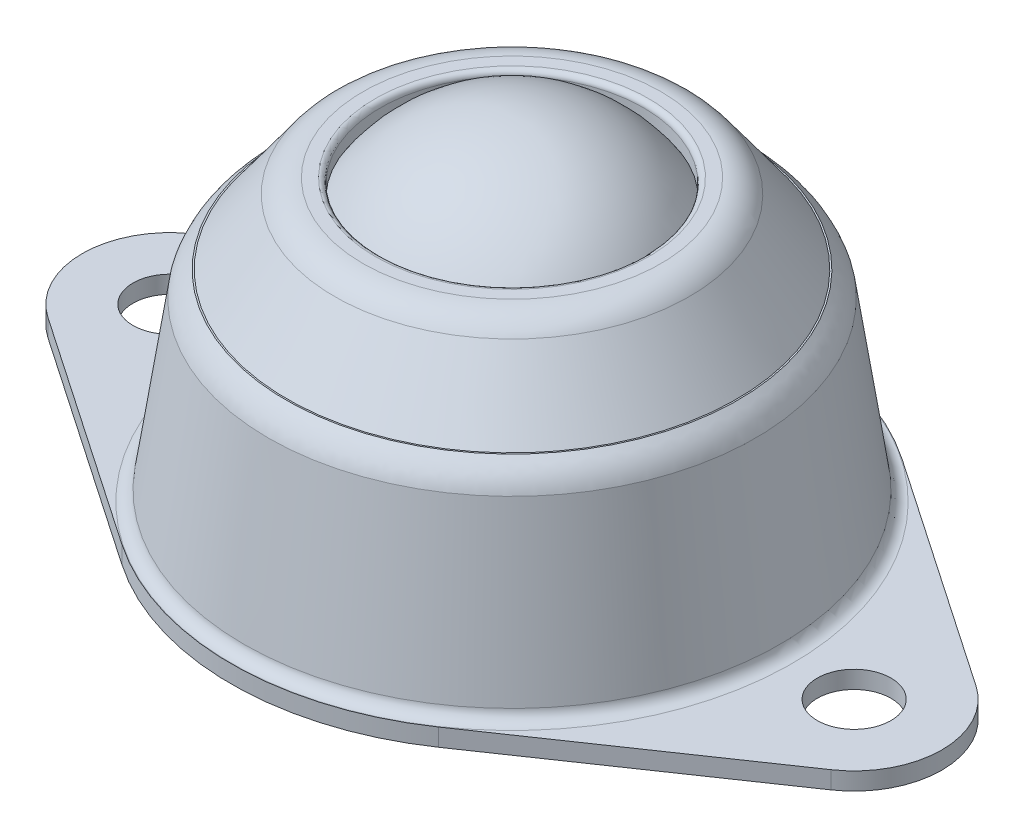
ISO-10303-21;
HEADER;
FILE_DESCRIPTION(('STEP AP214'),'2;1');
FILE_NAME('part.step','',(''),(''),'','','');
FILE_SCHEMA(('AUTOMOTIVE_DESIGN { 1 0 10303 214 1 1 1 1 }'));
ENDSEC;
DATA;
#1=APPLICATION_CONTEXT('core data for automotive mechanical design processes');
#2=APPLICATION_PROTOCOL_DEFINITION('international standard','automotive_design',2000,#1);
#3=PRODUCT_CONTEXT('',#1,'mechanical');
#4=PRODUCT('Part','Part','',(#3));
#5=PRODUCT_RELATED_PRODUCT_CATEGORY('part','',(#4));
#6=PRODUCT_DEFINITION_FORMATION('','',#4);
#7=PRODUCT_DEFINITION_CONTEXT('part definition',#1,'design');
#8=PRODUCT_DEFINITION('design','',#6,#7);
#9=PRODUCT_DEFINITION_SHAPE('','',#8);
#10=(LENGTH_UNIT() NAMED_UNIT(*) SI_UNIT(.MILLI.,.METRE.));
#11=(NAMED_UNIT(*) PLANE_ANGLE_UNIT() SI_UNIT($,.RADIAN.));
#12=(NAMED_UNIT(*) SI_UNIT($,.STERADIAN.) SOLID_ANGLE_UNIT());
#13=UNCERTAINTY_MEASURE_WITH_UNIT(LENGTH_MEASURE(1.E-05),#10,'distance_accuracy_value','');
#14=(GEOMETRIC_REPRESENTATION_CONTEXT(3) GLOBAL_UNCERTAINTY_ASSIGNED_CONTEXT((#13)) GLOBAL_UNIT_ASSIGNED_CONTEXT((#10,
#11,#12)) REPRESENTATION_CONTEXT('',''));
#15=CARTESIAN_POINT('',(0.,0.,0.));
#16=DIRECTION('',(0.,0.,1.));
#17=DIRECTION('',(1.,0.,0.));
#18=AXIS2_PLACEMENT_3D('',#15,#16,#17);
#19=CARTESIAN_POINT('',(-1.95060973816518,4.60747050791385,49.));
#20=DIRECTION('',(0.,1.,0.));
#21=DIRECTION('',(1.,0.,0.));
#22=AXIS2_PLACEMENT_3D('',#19,#20,#21);
#23=SPHERICAL_SURFACE('',#22,9.);
#24=CARTESIAN_POINT('',(-1.95060973816518,13.6074705079139,49.));
#25=VERTEX_POINT('',#24);
#26=VERTEX_LOOP('',#25);
#27=FACE_BOUND('',#26,.T.);
#28=ADVANCED_FACE('P0_F12',(#27),#23,.T.);
#29=CLOSED_SHELL('',(#28));
#30=MANIFOLD_SOLID_BREP('P0_B1',#29);
#31=CARTESIAN_POINT('',(-1.95060973816518,-6.2716566454268,49.));
#32=DIRECTION('',(0.,-1.,0.));
#33=DIRECTION('',(0.,0.,-1.));
#34=AXIS2_PLACEMENT_3D('',#31,#32,#33);
#35=CONICAL_SURFACE('',#34,15.4892940830772,0.146458693317037);
#36=CARTESIAN_POINT('',(-1.95060973816518,-4.81974726934143,49.));
#37=DIRECTION('',(0.,1.,0.));
#38=DIRECTION('',(0.,0.,1.));
#39=AXIS2_PLACEMENT_3D('',#36,#37,#38);
#40=CIRCLE('',#39,15.2751157529741);
#41=CARTESIAN_POINT('',(-1.95060973816518,-4.81974726934143,64.2751157529741));
#42=VERTEX_POINT('',#41);
#43=EDGE_CURVE('P1_E210',#42,#42,#40,.T.);
#44=ORIENTED_EDGE('',*,*,#43,.T.);
#45=EDGE_LOOP('',(#44));
#46=FACE_BOUND('',#45,.T.);
#47=CARTESIAN_POINT('',(-1.95060973816518,4.66035819329168,49.));
#48=DIRECTION('',(0.,-1.,0.));
#49=DIRECTION('',(0.,0.,-1.));
#50=AXIS2_PLACEMENT_3D('',#47,#48,#49);
#51=CIRCLE('',#50,13.8766585278661);
#52=CARTESIAN_POINT('',(-1.95060973816518,4.66035819329168,35.1233414721339));
#53=VERTEX_POINT('',#52);
#54=EDGE_CURVE('P1_E213',#53,#53,#51,.T.);
#55=ORIENTED_EDGE('',*,*,#54,.T.);
#56=EDGE_LOOP('',(#55));
#57=FACE_BOUND('',#56,.T.);
#58=ADVANCED_FACE('P1_F16',(#46,#57),#35,.T.);
#59=CARTESIAN_POINT('',(-10.441880643184,9.58240769344695,49.));
#60=DIRECTION('',(0.,1.,0.));
#61=DIRECTION('',(0.,0.,1.));
#62=AXIS2_PLACEMENT_3D('',#59,#60,#61);
#63=PLANE('',#62);
#64=CARTESIAN_POINT('',(-1.95060973816518,9.58240769344695,49.));
#65=DIRECTION('',(0.,-1.,0.));
#66=DIRECTION('',(0.,0.,-1.));
#67=AXIS2_PLACEMENT_3D('',#64,#65,#66);
#68=CIRCLE('',#67,7.5);
#69=CARTESIAN_POINT('',(-1.95060973816518,9.58240769344695,41.5));
#70=VERTEX_POINT('',#69);
#71=EDGE_CURVE('P1_E234',#70,#70,#68,.T.);
#72=ORIENTED_EDGE('',*,*,#71,.F.);
#73=EDGE_LOOP('',(#72));
#74=FACE_BOUND('',#73,.T.);
#75=CARTESIAN_POINT('',(-1.95060973816518,9.58240769344695,49.));
#76=DIRECTION('',(0.,-1.,0.));
#77=DIRECTION('',(0.,0.,-1.));
#78=AXIS2_PLACEMENT_3D('',#75,#76,#77);
#79=CIRCLE('',#78,8.49127090501881);
#80=CARTESIAN_POINT('',(-1.95060973816518,9.58240769344695,40.5087290949812));
#81=VERTEX_POINT('',#80);
#82=EDGE_CURVE('P1_E145',#81,#81,#79,.T.);
#83=ORIENTED_EDGE('',*,*,#82,.T.);
#84=EDGE_LOOP('',(#83));
#85=FACE_BOUND('',#84,.T.);
#86=ADVANCED_FACE('P1_F184',(#74,#85),#63,.F.);
#87=CARTESIAN_POINT('',(-1.95060973816518,-11.8288477178085,49.));
#88=DIRECTION('',(0.,-1.,0.));
#89=DIRECTION('',(0.,0.,-1.));
#90=AXIS2_PLACEMENT_3D('',#87,#88,#89);
#91=CYLINDRICAL_SURFACE('',#90,7.5);
#92=CARTESIAN_POINT('',(-1.95060973816518,10.282407693447,49.));
#93=DIRECTION('',(0.,1.,0.));
#94=DIRECTION('',(0.,0.,1.));
#95=AXIS2_PLACEMENT_3D('',#92,#93,#94);
#96=CIRCLE('',#95,7.5);
#97=CARTESIAN_POINT('',(-1.95060973816518,10.282407693447,56.5));
#98=VERTEX_POINT('',#97);
#99=EDGE_CURVE('P1_E11',#98,#98,#96,.T.);
#100=ORIENTED_EDGE('',*,*,#99,.T.);
#101=EDGE_LOOP('',(#100));
#102=FACE_BOUND('',#101,.T.);
#103=ORIENTED_EDGE('',*,*,#71,.T.);
#104=EDGE_LOOP('',(#103));
#105=FACE_BOUND('',#104,.T.);
#106=ADVANCED_FACE('P1_F180',(#102,#105),#91,.F.);
#107=CARTESIAN_POINT('',(-10.441880643184,10.582407693447,49.));
#108=DIRECTION('',(0.,1.,0.));
#109=DIRECTION('',(0.,0.,1.));
#110=AXIS2_PLACEMENT_3D('',#107,#108,#109);
#111=PLANE('',#110);
#112=CARTESIAN_POINT('',(-1.95060973816518,10.582407693447,49.));
#113=DIRECTION('',(0.,1.,0.));
#114=DIRECTION('',(0.,0.,1.));
#115=AXIS2_PLACEMENT_3D('',#112,#113,#114);
#116=CIRCLE('',#115,7.8);
#117=CARTESIAN_POINT('',(-1.95060973816518,10.582407693447,56.8));
#118=VERTEX_POINT('',#117);
#119=EDGE_CURVE('P1_E25',#118,#118,#116,.F.);
#120=ORIENTED_EDGE('',*,*,#119,.T.);
#121=EDGE_LOOP('',(#120));
#122=FACE_BOUND('',#121,.T.);
#123=CARTESIAN_POINT('',(-1.95060973816518,10.582407693447,49.));
#124=DIRECTION('',(0.,-1.,0.));
#125=DIRECTION('',(0.,0.,-1.));
#126=AXIS2_PLACEMENT_3D('',#123,#124,#125);
#127=CIRCLE('',#126,8.4912709050188);
#128=CARTESIAN_POINT('',(-1.95060973816518,10.582407693447,40.5087290949812));
#129=VERTEX_POINT('',#128);
#130=EDGE_CURVE('P1_E231',#129,#129,#127,.T.);
#131=ORIENTED_EDGE('',*,*,#130,.F.);
#132=EDGE_LOOP('',(#131));
#133=FACE_BOUND('',#132,.T.);
#134=ADVANCED_FACE('P1_F176',(#122,#133),#111,.T.);
#135=CARTESIAN_POINT('',(-1.95060973816518,8.58240769344695,49.));
#136=DIRECTION('',(0.,-1.,0.));
#137=DIRECTION('',(0.,0.,-1.));
#138=AXIS2_PLACEMENT_3D('',#135,#136,#137);
#139=TOROIDAL_SURFACE('',#138,8.49127090501881,2.);
#140=ORIENTED_EDGE('',*,*,#130,.T.);
#141=EDGE_LOOP('',(#140));
#142=FACE_BOUND('',#141,.T.);
#143=CARTESIAN_POINT('',(-1.95060973816518,9.76002382293537,49.));
#144=DIRECTION('',(0.,-1.,0.));
#145=DIRECTION('',(0.,0.,-1.));
#146=AXIS2_PLACEMENT_3D('',#143,#144,#145);
#147=CIRCLE('',#146,10.1078166827711);
#148=CARTESIAN_POINT('',(-1.95060973816518,9.76002382293537,38.8921833172289));
#149=VERTEX_POINT('',#148);
#150=EDGE_CURVE('P1_E228',#149,#149,#147,.T.);
#151=ORIENTED_EDGE('',*,*,#150,.F.);
#152=EDGE_LOOP('',(#151));
#153=FACE_BOUND('',#152,.T.);
#154=ADVANCED_FACE('P1_F172',(#142,#153),#139,.T.);
#155=CARTESIAN_POINT('',(-1.95060973816518,6.05240769344696,49.));
#156=DIRECTION('',(0.,-1.,0.));
#157=DIRECTION('',(0.,0.,-1.));
#158=AXIS2_PLACEMENT_3D('',#155,#156,#157);
#159=CONICAL_SURFACE('',#158,12.8087290949812,0.629583377949077);
#160=ORIENTED_EDGE('',*,*,#150,.T.);
#161=EDGE_LOOP('',(#160));
#162=FACE_BOUND('',#161,.T.);
#163=CARTESIAN_POINT('',(-1.95060973816518,6.05240769344696,49.));
#164=DIRECTION('',(0.,-1.,0.));
#165=DIRECTION('',(0.,0.,-1.));
#166=AXIS2_PLACEMENT_3D('',#163,#164,#165);
#167=CIRCLE('',#166,12.8087290949812);
#168=CARTESIAN_POINT('',(-1.95060973816518,6.05240769344696,36.1912709050188));
#169=VERTEX_POINT('',#168);
#170=EDGE_CURVE('P1_E219',#169,#169,#167,.T.);
#171=ORIENTED_EDGE('',*,*,#170,.F.);
#172=EDGE_LOOP('',(#171));
#173=FACE_BOUND('',#172,.T.);
#174=ADVANCED_FACE('P1_F168',(#162,#173),#159,.T.);
#175=CARTESIAN_POINT('',(-14.4506097381652,6.05240769344696,49.));
#176=DIRECTION('',(0.,1.,0.));
#177=DIRECTION('',(0.,0.,1.));
#178=AXIS2_PLACEMENT_3D('',#175,#176,#177);
#179=PLANE('',#178);
#180=ORIENTED_EDGE('',*,*,#170,.T.);
#181=EDGE_LOOP('',(#180));
#182=FACE_BOUND('',#181,.T.);
#183=CARTESIAN_POINT('',(-1.95060973816518,6.05240769344696,49.));
#184=DIRECTION('',(0.,-1.,0.));
#185=DIRECTION('',(0.,0.,-1.));
#186=AXIS2_PLACEMENT_3D('',#183,#184,#185);
#187=CIRCLE('',#186,12.8924283725623);
#188=CARTESIAN_POINT('',(-1.95060973816518,6.05240769344696,36.1075716274377));
#189=VERTEX_POINT('',#188);
#190=EDGE_CURVE('P1_E215',#189,#189,#187,.T.);
#191=ORIENTED_EDGE('',*,*,#190,.F.);
#192=EDGE_LOOP('',(#191));
#193=FACE_BOUND('',#192,.T.);
#194=ADVANCED_FACE('P1_F163',(#182,#193),#179,.T.);
#195=CARTESIAN_POINT('',(-15.8272682660313,4.66035819329168,49.));
#196=CARTESIAN_POINT('',(-15.8191064758816,4.6850538361552,49.));
#197=CARTESIAN_POINT('',(-15.8109446857319,4.70974947901874,49.));
#198=CARTESIAN_POINT('',(-15.7987020005074,4.74679294331405,49.));
#199=CARTESIAN_POINT('',(-15.7911287345074,4.76948983380939,49.));
#200=CARTESIAN_POINT('',(-15.7770840785491,4.80940371465037,49.));
#201=CARTESIAN_POINT('',(-15.7698122009523,4.82928423418318,49.));
#202=CARTESIAN_POINT('',(-15.7321998455869,4.92826674440635,49.));
#203=CARTESIAN_POINT('',(-15.6980871010981,5.0061120716949,49.));
#204=CARTESIAN_POINT('',(-15.5837877947078,5.23405301989266,49.));
#205=CARTESIAN_POINT('',(-15.4914830555105,5.37844839844446,49.));
#206=CARTESIAN_POINT('',(-15.332366465786,5.57789851980176,49.));
#207=CARTESIAN_POINT('',(-15.275927162519,5.64154493597412,49.));
#208=CARTESIAN_POINT('',(-15.2016988288033,5.7172023017542,49.));
#209=CARTESIAN_POINT('',(-15.1791547246241,5.73960822377018,49.));
#210=CARTESIAN_POINT('',(-15.1562139194125,5.761571084609,49.));
#211=CARTESIAN_POINT('',(-15.1408337457316,5.77611401301725,49.));
#212=CARTESIAN_POINT('',(-15.1321701874857,5.78417215198515,49.));
#213=CARTESIAN_POINT('',(-15.1084708369317,5.8061586717771,49.));
#214=CARTESIAN_POINT('',(-15.0136734347159,5.89410475094492,49.));
#215=CARTESIAN_POINT('',(-14.9188760325001,5.98205083011271,49.));
#216=CARTESIAN_POINT('',(-14.8430381107275,6.05240769344696,49.));
#217=B_SPLINE_CURVE_WITH_KNOTS('',3,(#195,#196,#197,#198,#199,#200,#201,#202,#203,#204,#205,
#206,#207,#208,#209,#210,#211,#212,#213,#214,#215,#216),.UNSPECIFIED.,.F.,.F.,(4,2,2,2,2,2,2,1,
2,2,1,4),(0.,0.0624999999999958,0.0937499999999931,0.12499999999999,0.24999999999998,
0.49999999999996,0.624999999999951,0.656249999999949,0.671874999999948,0.687499999999948,
0.749999999999959,1.),.UNSPECIFIED.);
#218=CARTESIAN_POINT('',(-1.95060973816518,-11.8288477178085,49.));
#219=DIRECTION('',(0.,-1.,0.));
#220=AXIS1_PLACEMENT('',#218,#219);
#221=SURFACE_OF_REVOLUTION('',#217,#220);
#222=ORIENTED_EDGE('',*,*,#190,.T.);
#223=EDGE_LOOP('',(#222));
#224=FACE_BOUND('',#223,.T.);
#225=ORIENTED_EDGE('',*,*,#54,.F.);
#226=EDGE_LOOP('',(#225));
#227=FACE_BOUND('',#226,.T.);
#228=ADVANCED_FACE('P1_F158',(#224,#227),#221,.F.);
#229=CARTESIAN_POINT('',(-1.95060973816518,-6.41759230655305,49.));
#230=DIRECTION('',(0.,-1.,0.));
#231=DIRECTION('',(0.,0.,-1.));
#232=AXIS2_PLACEMENT_3D('',#229,#230,#231);
#233=CONICAL_SURFACE('',#232,14.5,0.146458693317037);
#234=CARTESIAN_POINT('',(-1.95060973816518,4.4287664292616,49.));
#235=DIRECTION('',(0.,-1.,0.));
#236=DIRECTION('',(0.,0.,-1.));
#237=AXIS2_PLACEMENT_3D('',#234,#235,#236);
#238=CIRCLE('',#237,12.9);
#239=CARTESIAN_POINT('',(-1.95060973816518,4.4287664292616,36.1));
#240=VERTEX_POINT('',#239);
#241=EDGE_CURVE('P1_E216',#240,#240,#238,.T.);
#242=ORIENTED_EDGE('',*,*,#241,.F.);
#243=EDGE_LOOP('',(#242));
#244=FACE_BOUND('',#243,.T.);
#245=CARTESIAN_POINT('',(-1.95060973816518,-6.41759230655305,49.));
#246=DIRECTION('',(0.,1.,0.));
#247=DIRECTION('',(0.,0.,1.));
#248=AXIS2_PLACEMENT_3D('',#245,#246,#247);
#249=CIRCLE('',#248,14.5);
#250=CARTESIAN_POINT('',(-1.95060973816518,-6.41759230655305,63.5));
#251=VERTEX_POINT('',#250);
#252=EDGE_CURVE('P1_E311',#251,#251,#249,.T.);
#253=ORIENTED_EDGE('',*,*,#252,.F.);
#254=EDGE_LOOP('',(#253));
#255=FACE_BOUND('',#254,.T.);
#256=ADVANCED_FACE('P1_F162',(#244,#255),#233,.F.);
#257=CARTESIAN_POINT('',(-14.8506097381652,4.4287664292616,49.));
#258=CARTESIAN_POINT('',(-14.730234992126,4.79299188513002,49.));
#259=CARTESIAN_POINT('',(-14.4506097381652,5.05240769344695,49.));
#260=B_SPLINE_CURVE_WITH_KNOTS('',2,(#257,#258,#259),.UNSPECIFIED.,.F.,.F.,(3,3),(0.,1.),.UNSPECIFIED.);
#261=CARTESIAN_POINT('',(-1.95060973816518,-11.8288477178085,49.));
#262=DIRECTION('',(0.,-1.,0.));
#263=AXIS1_PLACEMENT('',#261,#262);
#264=SURFACE_OF_REVOLUTION('',#260,#263);
#265=CARTESIAN_POINT('',(-1.95060973816518,5.05240769344695,49.));
#266=DIRECTION('',(0.,-1.,0.));
#267=DIRECTION('',(0.,0.,-1.));
#268=AXIS2_PLACEMENT_3D('',#265,#266,#267);
#269=CIRCLE('',#268,12.5);
#270=CARTESIAN_POINT('',(-1.95060973816518,5.05240769344695,36.5));
#271=VERTEX_POINT('',#270);
#272=EDGE_CURVE('P1_E222',#271,#271,#269,.T.);
#273=ORIENTED_EDGE('',*,*,#272,.F.);
#274=EDGE_LOOP('',(#273));
#275=FACE_BOUND('',#274,.T.);
#276=ORIENTED_EDGE('',*,*,#241,.T.);
#277=EDGE_LOOP('',(#276));
#278=FACE_BOUND('',#277,.T.);
#279=ADVANCED_FACE('P1_F299',(#275,#278),#264,.T.);
#280=CARTESIAN_POINT('',(-14.4506097381652,5.05240769344695,49.));
#281=DIRECTION('',(0.,1.,0.));
#282=DIRECTION('',(0.,0.,1.));
#283=AXIS2_PLACEMENT_3D('',#280,#281,#282);
#284=PLANE('',#283);
#285=CARTESIAN_POINT('',(-1.95060973816518,5.05240769344695,49.));
#286=DIRECTION('',(0.,-1.,0.));
#287=DIRECTION('',(0.,0.,-1.));
#288=AXIS2_PLACEMENT_3D('',#285,#286,#287);
#289=CIRCLE('',#288,12.3);
#290=CARTESIAN_POINT('',(-1.95060973816518,5.05240769344695,36.7));
#291=VERTEX_POINT('',#290);
#292=EDGE_CURVE('P1_E517',#291,#291,#289,.T.);
#293=ORIENTED_EDGE('',*,*,#292,.F.);
#294=EDGE_LOOP('',(#293));
#295=FACE_BOUND('',#294,.T.);
#296=ORIENTED_EDGE('',*,*,#272,.T.);
#297=EDGE_LOOP('',(#296));
#298=FACE_BOUND('',#297,.T.);
#299=ADVANCED_FACE('P1_F295',(#295,#298),#284,.F.);
#300=CARTESIAN_POINT('',(-1.95060973816518,5.05240769344695,49.));
#301=DIRECTION('',(0.,-1.,0.));
#302=DIRECTION('',(0.,0.,-1.));
#303=AXIS2_PLACEMENT_3D('',#300,#301,#302);
#304=CONICAL_SURFACE('',#303,12.3,0.629583377949078);
#305=CARTESIAN_POINT('',(-1.95060973816518,9.17121575819116,49.));
#306=DIRECTION('',(0.,-1.,0.));
#307=DIRECTION('',(0.,0.,-1.));
#308=AXIS2_PLACEMENT_3D('',#305,#306,#307);
#309=CIRCLE('',#308,9.29954379389495);
#310=CARTESIAN_POINT('',(-1.95060973816518,9.17121575819116,39.700456206105));
#311=VERTEX_POINT('',#310);
#312=EDGE_CURVE('P1_E519',#311,#311,#309,.T.);
#313=ORIENTED_EDGE('',*,*,#312,.F.);
#314=EDGE_LOOP('',(#313));
#315=FACE_BOUND('',#314,.T.);
#316=ORIENTED_EDGE('',*,*,#292,.T.);
#317=EDGE_LOOP('',(#316));
#318=FACE_BOUND('',#317,.T.);
#319=ADVANCED_FACE('P1_F263',(#315,#318),#304,.F.);
#320=CARTESIAN_POINT('',(-1.95060973816518,8.58240769344695,49.));
#321=DIRECTION('',(0.,-1.,0.));
#322=DIRECTION('',(0.,0.,-1.));
#323=AXIS2_PLACEMENT_3D('',#320,#321,#322);
#324=TOROIDAL_SURFACE('',#323,8.49127090501881,1.);
#325=ORIENTED_EDGE('',*,*,#82,.F.);
#326=EDGE_LOOP('',(#325));
#327=FACE_BOUND('',#326,.T.);
#328=ORIENTED_EDGE('',*,*,#312,.T.);
#329=EDGE_LOOP('',(#328));
#330=FACE_BOUND('',#329,.T.);
#331=ADVANCED_FACE('P1_F254',(#327,#330),#324,.F.);
#332=CARTESIAN_POINT('',(17.5493902618348,-5.41759230655305,49.));
#333=DIRECTION('',(0.,-1.,0.));
#334=DIRECTION('',(0.,0.,-1.));
#335=AXIS2_PLACEMENT_3D('',#332,#333,#334);
#336=PLANE('',#335);
#337=CARTESIAN_POINT('',(-1.95060973816518,-5.41759230655305,49.));
#338=DIRECTION('',(0.,-1.,0.));
#339=DIRECTION('',(0.,0.,-1.));
#340=AXIS2_PLACEMENT_3D('',#337,#338,#339);
#341=CIRCLE('',#340,15.9676216111282);
#342=CARTESIAN_POINT('',(-1.95060973816518,-5.41759230655305,33.0323783888718));
#343=VERTEX_POINT('',#342);
#344=EDGE_CURVE('P1_E238',#343,#343,#341,.T.);
#345=ORIENTED_EDGE('',*,*,#344,.T.);
#346=EDGE_LOOP('',(#345));
#347=FACE_BOUND('',#346,.T.);
#348=CARTESIAN_POINT('',(17.5493902618348,-5.41759230655305,49.));
#349=DIRECTION('',(0.,1.,0.));
#350=DIRECTION('',(0.,0.,-1.));
#351=AXIS2_PLACEMENT_3D('',#348,#349,#350);
#352=CIRCLE('',#351,5.);
#353=CARTESIAN_POINT('',(20.3699030823476,-5.41759230655305,53.1285236379755));
#354=VERTEX_POINT('',#353);
#355=CARTESIAN_POINT('',(20.3699030823476,-5.41759230655305,44.8714763620244));
#356=VERTEX_POINT('',#355);
#357=EDGE_CURVE('P1_E130',#354,#356,#352,.T.);
#358=ORIENTED_EDGE('',*,*,#357,.T.);
#359=DIRECTION('',(-0.825704727595109,0.,-0.564102564102564));
#360=VECTOR('',#359,1.);
#361=CARTESIAN_POINT('',(20.3699030823476,-5.41759230655305,44.8714763620244));
#362=LINE('',#361,#360);
#363=CARTESIAN_POINT('',(7.07503128747584,-5.41759230655305,35.7887243584783));
#364=VERTEX_POINT('',#363);
#365=EDGE_CURVE('P1_E77',#356,#364,#362,.T.);
#366=ORIENTED_EDGE('',*,*,#365,.T.);
#367=CARTESIAN_POINT('',(-1.95060973816518,-5.41759230655305,49.));
#368=DIRECTION('',(0.,1.,0.));
#369=DIRECTION('',(0.,0.,1.));
#370=AXIS2_PLACEMENT_3D('',#367,#368,#369);
#371=CIRCLE('',#370,16.);
#372=CARTESIAN_POINT('',(-10.9762507638062,-5.41759230655305,35.7887243584783));
#373=VERTEX_POINT('',#372);
#374=EDGE_CURVE('P1_E328',#364,#373,#371,.T.);
#375=ORIENTED_EDGE('',*,*,#374,.T.);
#376=DIRECTION('',(-0.825704727595109,0.,0.564102564102564));
#377=VECTOR('',#376,1.);
#378=CARTESIAN_POINT('',(-24.271122558678,-5.41759230655305,44.8714763620244));
#379=LINE('',#378,#377);
#380=CARTESIAN_POINT('',(-24.271122558678,-5.41759230655305,44.8714763620244));
#381=VERTEX_POINT('',#380);
#382=EDGE_CURVE('P1_E330',#373,#381,#379,.T.);
#383=ORIENTED_EDGE('',*,*,#382,.T.);
#384=CARTESIAN_POINT('',(-21.4506097381652,-5.41759230655305,49.));
#385=DIRECTION('',(0.,1.,0.));
#386=DIRECTION('',(0.,0.,1.));
#387=AXIS2_PLACEMENT_3D('',#384,#385,#386);
#388=CIRCLE('',#387,5.);
#389=CARTESIAN_POINT('',(-24.271122558678,-5.41759230655305,53.1285236379755));
#390=VERTEX_POINT('',#389);
#391=EDGE_CURVE('P1_E97',#381,#390,#388,.T.);
#392=ORIENTED_EDGE('',*,*,#391,.T.);
#393=DIRECTION('',(0.825704727595109,0.,0.564102564102564));
#394=VECTOR('',#393,1.);
#395=CARTESIAN_POINT('',(-24.271122558678,-5.41759230655305,53.1285236379755));
#396=LINE('',#395,#394);
#397=CARTESIAN_POINT('',(-10.9762507638062,-5.41759230655305,62.2112756415217));
#398=VERTEX_POINT('',#397);
#399=EDGE_CURVE('P1_E90',#390,#398,#396,.T.);
#400=ORIENTED_EDGE('',*,*,#399,.T.);
#401=CARTESIAN_POINT('',(-1.95060973816518,-5.41759230655305,49.));
#402=DIRECTION('',(0.,1.,0.));
#403=DIRECTION('',(0.,0.,-1.));
#404=AXIS2_PLACEMENT_3D('',#401,#402,#403);
#405=CIRCLE('',#404,16.);
#406=CARTESIAN_POINT('',(7.07503128747584,-5.41759230655305,62.2112756415217));
#407=VERTEX_POINT('',#406);
#408=EDGE_CURVE('P1_E95',#398,#407,#405,.T.);
#409=ORIENTED_EDGE('',*,*,#408,.T.);
#410=DIRECTION('',(0.825704727595109,0.,-0.564102564102564));
#411=VECTOR('',#410,1.);
#412=CARTESIAN_POINT('',(20.3699030823476,-5.41759230655305,53.1285236379755));
#413=LINE('',#412,#411);
#414=EDGE_CURVE('P1_E33',#407,#354,#413,.T.);
#415=ORIENTED_EDGE('',*,*,#414,.T.);
#416=EDGE_LOOP('',(#358,#366,#375,#383,#392,#400,#409,#415));
#417=FACE_BOUND('',#416,.T.);
#418=CARTESIAN_POINT('',(-21.4506097381652,-5.41759230655305,49.));
#419=DIRECTION('',(0.,1.,0.));
#420=DIRECTION('',(0.,0.,1.));
#421=AXIS2_PLACEMENT_3D('',#418,#419,#420);
#422=CIRCLE('',#421,2.1);
#423=CARTESIAN_POINT('',(-21.4506097381652,-5.41759230655305,51.1));
#424=VERTEX_POINT('',#423);
#425=EDGE_CURVE('P1_E119',#424,#424,#422,.T.);
#426=ORIENTED_EDGE('',*,*,#425,.F.);
#427=EDGE_LOOP('',(#426));
#428=FACE_BOUND('',#427,.T.);
#429=CARTESIAN_POINT('',(17.5493902618348,-5.41759230655305,49.));
#430=DIRECTION('',(0.,1.,0.));
#431=DIRECTION('',(0.,0.,-1.));
#432=AXIS2_PLACEMENT_3D('',#429,#430,#431);
#433=CIRCLE('',#432,2.1);
#434=CARTESIAN_POINT('',(17.5493902618348,-5.41759230655305,46.9));
#435=VERTEX_POINT('',#434);
#436=EDGE_CURVE('P1_E316',#435,#435,#433,.T.);
#437=ORIENTED_EDGE('',*,*,#436,.F.);
#438=EDGE_LOOP('',(#437));
#439=FACE_BOUND('',#438,.T.);
#440=ADVANCED_FACE('P1_F92',(#347,#417,#428,#439),#336,.F.);
#441=CARTESIAN_POINT('',(17.5493902618348,-6.41759230655305,49.));
#442=DIRECTION('',(0.,-1.,0.));
#443=DIRECTION('',(0.,0.,-1.));
#444=AXIS2_PLACEMENT_3D('',#441,#442,#443);
#445=PLANE('',#444);
#446=CARTESIAN_POINT('',(17.5493902618348,-6.41759230655305,49.));
#447=DIRECTION('',(0.,1.,0.));
#448=DIRECTION('',(0.,0.,-1.));
#449=AXIS2_PLACEMENT_3D('',#446,#447,#448);
#450=CIRCLE('',#449,2.1);
#451=CARTESIAN_POINT('',(17.5493902618348,-6.41759230655305,46.9));
#452=VERTEX_POINT('',#451);
#453=EDGE_CURVE('P1_E313',#452,#452,#450,.T.);
#454=ORIENTED_EDGE('',*,*,#453,.T.);
#455=EDGE_LOOP('',(#454));
#456=FACE_BOUND('',#455,.T.);
#457=CARTESIAN_POINT('',(17.5493902618348,-6.41759230655305,49.));
#458=DIRECTION('',(0.,1.,0.));
#459=DIRECTION('',(0.,0.,-1.));
#460=AXIS2_PLACEMENT_3D('',#457,#458,#459);
#461=CIRCLE('',#460,5.);
#462=CARTESIAN_POINT('',(20.3699030823476,-6.41759230655305,53.1285236379755));
#463=VERTEX_POINT('',#462);
#464=CARTESIAN_POINT('',(20.3699030823476,-6.41759230655305,44.8714763620244));
#465=VERTEX_POINT('',#464);
#466=EDGE_CURVE('P1_E115',#463,#465,#461,.T.);
#467=ORIENTED_EDGE('',*,*,#466,.F.);
#468=DIRECTION('',(0.825704727595109,0.,-0.564102564102564));
#469=VECTOR('',#468,1.);
#470=CARTESIAN_POINT('',(20.3699030823476,-6.41759230655305,53.1285236379755));
#471=LINE('',#470,#469);
#472=CARTESIAN_POINT('',(7.07503128747584,-6.41759230655305,62.2112756415217));
#473=VERTEX_POINT('',#472);
#474=EDGE_CURVE('P1_E68',#473,#463,#471,.T.);
#475=ORIENTED_EDGE('',*,*,#474,.F.);
#476=CARTESIAN_POINT('',(-1.95060973816518,-6.41759230655305,49.));
#477=DIRECTION('',(0.,1.,0.));
#478=DIRECTION('',(0.,0.,-1.));
#479=AXIS2_PLACEMENT_3D('',#476,#477,#478);
#480=CIRCLE('',#479,16.);
#481=CARTESIAN_POINT('',(-10.9762507638062,-6.41759230655305,62.2112756415217));
#482=VERTEX_POINT('',#481);
#483=EDGE_CURVE('P1_E62',#482,#473,#480,.T.);
#484=ORIENTED_EDGE('',*,*,#483,.F.);
#485=DIRECTION('',(0.825704727595109,0.,0.564102564102564));
#486=VECTOR('',#485,1.);
#487=CARTESIAN_POINT('',(-24.271122558678,-6.41759230655305,53.1285236379755));
#488=LINE('',#487,#486);
#489=CARTESIAN_POINT('',(-24.271122558678,-6.41759230655305,53.1285236379755));
#490=VERTEX_POINT('',#489);
#491=EDGE_CURVE('P1_E105',#490,#482,#488,.T.);
#492=ORIENTED_EDGE('',*,*,#491,.F.);
#493=CARTESIAN_POINT('',(-21.4506097381652,-6.41759230655305,49.));
#494=DIRECTION('',(0.,1.,0.));
#495=DIRECTION('',(0.,0.,1.));
#496=AXIS2_PLACEMENT_3D('',#493,#494,#495);
#497=CIRCLE('',#496,5.);
#498=CARTESIAN_POINT('',(-24.271122558678,-6.41759230655305,44.8714763620244));
#499=VERTEX_POINT('',#498);
#500=EDGE_CURVE('P1_E125',#499,#490,#497,.T.);
#501=ORIENTED_EDGE('',*,*,#500,.F.);
#502=DIRECTION('',(-0.825704727595109,0.,0.564102564102564));
#503=VECTOR('',#502,1.);
#504=CARTESIAN_POINT('',(-24.271122558678,-6.41759230655305,44.8714763620244));
#505=LINE('',#504,#503);
#506=CARTESIAN_POINT('',(-10.9762507638062,-6.41759230655305,35.7887243584783));
#507=VERTEX_POINT('',#506);
#508=EDGE_CURVE('P1_E123',#507,#499,#505,.T.);
#509=ORIENTED_EDGE('',*,*,#508,.F.);
#510=CARTESIAN_POINT('',(-1.95060973816518,-6.41759230655305,49.));
#511=DIRECTION('',(0.,1.,0.));
#512=DIRECTION('',(0.,0.,1.));
#513=AXIS2_PLACEMENT_3D('',#510,#511,#512);
#514=CIRCLE('',#513,16.);
#515=CARTESIAN_POINT('',(7.07503128747584,-6.41759230655305,35.7887243584783));
#516=VERTEX_POINT('',#515);
#517=EDGE_CURVE('P1_E121',#516,#507,#514,.T.);
#518=ORIENTED_EDGE('',*,*,#517,.F.);
#519=DIRECTION('',(-0.825704727595109,0.,-0.564102564102564));
#520=VECTOR('',#519,1.);
#521=CARTESIAN_POINT('',(20.3699030823476,-6.41759230655305,44.8714763620244));
#522=LINE('',#521,#520);
#523=EDGE_CURVE('P1_E118',#465,#516,#522,.T.);
#524=ORIENTED_EDGE('',*,*,#523,.F.);
#525=EDGE_LOOP('',(#467,#475,#484,#492,#501,#509,#518,#524));
#526=FACE_BOUND('',#525,.T.);
#527=CARTESIAN_POINT('',(-21.4506097381652,-6.41759230655305,49.));
#528=DIRECTION('',(0.,1.,0.));
#529=DIRECTION('',(0.,0.,1.));
#530=AXIS2_PLACEMENT_3D('',#527,#528,#529);
#531=CIRCLE('',#530,2.1);
#532=CARTESIAN_POINT('',(-21.4506097381652,-6.41759230655305,51.1));
#533=VERTEX_POINT('',#532);
#534=EDGE_CURVE('P1_E320',#533,#533,#531,.T.);
#535=ORIENTED_EDGE('',*,*,#534,.T.);
#536=EDGE_LOOP('',(#535));
#537=FACE_BOUND('',#536,.T.);
#538=ORIENTED_EDGE('',*,*,#252,.T.);
#539=EDGE_LOOP('',(#538));
#540=FACE_BOUND('',#539,.T.);
#541=ADVANCED_FACE('P1_F253',(#456,#526,#537,#540),#445,.T.);
#542=CARTESIAN_POINT('',(17.5493902618348,-5.41759230655305,49.));
#543=DIRECTION('',(0.,-1.,0.));
#544=DIRECTION('',(0.,0.,-1.));
#545=AXIS2_PLACEMENT_3D('',#542,#543,#544);
#546=CYLINDRICAL_SURFACE('',#545,5.);
#547=ORIENTED_EDGE('',*,*,#466,.T.);
#548=DIRECTION('',(0.,-1.,0.));
#549=VECTOR('',#548,1.);
#550=CARTESIAN_POINT('',(20.3699030823476,-5.41759230655305,44.8714763620244));
#551=LINE('',#550,#549);
#552=EDGE_CURVE('P1_E143',#356,#465,#551,.T.);
#553=ORIENTED_EDGE('',*,*,#552,.F.);
#554=ORIENTED_EDGE('',*,*,#357,.F.);
#555=DIRECTION('',(0.,-1.,0.));
#556=VECTOR('',#555,1.);
#557=CARTESIAN_POINT('',(20.3699030823476,-5.41759230655305,53.1285236379755));
#558=LINE('',#557,#556);
#559=EDGE_CURVE('P1_E111',#354,#463,#558,.T.);
#560=ORIENTED_EDGE('',*,*,#559,.T.);
#561=EDGE_LOOP('',(#547,#553,#554,#560));
#562=FACE_BOUND('',#561,.T.);
#563=ADVANCED_FACE('P1_F260',(#562),#546,.T.);
#564=CARTESIAN_POINT('',(20.3699030823476,-5.41759230655305,44.8714763620244));
#565=DIRECTION('',(-0.564102564102564,0.,0.825704727595109));
#566=DIRECTION('',(0.825704727595109,0.,0.564102564102564));
#567=AXIS2_PLACEMENT_3D('',#564,#565,#566);
#568=PLANE('',#567);
#569=ORIENTED_EDGE('',*,*,#523,.T.);
#570=DIRECTION('',(0.,-1.,0.));
#571=VECTOR('',#570,1.);
#572=CARTESIAN_POINT('',(7.07503128747584,-5.41759230655305,35.7887243584783));
#573=LINE('',#572,#571);
#574=EDGE_CURVE('P1_E140',#364,#516,#573,.T.);
#575=ORIENTED_EDGE('',*,*,#574,.F.);
#576=ORIENTED_EDGE('',*,*,#365,.F.);
#577=ORIENTED_EDGE('',*,*,#552,.T.);
#578=EDGE_LOOP('',(#569,#575,#576,#577));
#579=FACE_BOUND('',#578,.T.);
#580=ADVANCED_FACE('P1_F286',(#579),#568,.F.);
#581=CARTESIAN_POINT('',(-1.95060973816518,-5.41759230655305,49.));
#582=DIRECTION('',(0.,-1.,0.));
#583=DIRECTION('',(0.,0.,-1.));
#584=AXIS2_PLACEMENT_3D('',#581,#582,#583);
#585=CYLINDRICAL_SURFACE('',#584,16.);
#586=ORIENTED_EDGE('',*,*,#517,.T.);
#587=DIRECTION('',(0.,-1.,0.));
#588=VECTOR('',#587,1.);
#589=CARTESIAN_POINT('',(-10.9762507638062,-5.41759230655305,35.7887243584783));
#590=LINE('',#589,#588);
#591=EDGE_CURVE('P1_E137',#373,#507,#590,.T.);
#592=ORIENTED_EDGE('',*,*,#591,.F.);
#593=ORIENTED_EDGE('',*,*,#374,.F.);
#594=ORIENTED_EDGE('',*,*,#574,.T.);
#595=EDGE_LOOP('',(#586,#592,#593,#594));
#596=FACE_BOUND('',#595,.T.);
#597=ADVANCED_FACE('P1_F282',(#596),#585,.T.);
#598=CARTESIAN_POINT('',(-24.271122558678,-5.41759230655305,44.8714763620244));
#599=DIRECTION('',(0.564102564102564,0.,0.825704727595109));
#600=DIRECTION('',(0.825704727595109,0.,-0.564102564102564));
#601=AXIS2_PLACEMENT_3D('',#598,#599,#600);
#602=PLANE('',#601);
#603=ORIENTED_EDGE('',*,*,#508,.T.);
#604=DIRECTION('',(0.,-1.,0.));
#605=VECTOR('',#604,1.);
#606=CARTESIAN_POINT('',(-24.271122558678,-5.41759230655305,44.8714763620244));
#607=LINE('',#606,#605);
#608=EDGE_CURVE('P1_E134',#381,#499,#607,.T.);
#609=ORIENTED_EDGE('',*,*,#608,.F.);
#610=ORIENTED_EDGE('',*,*,#382,.F.);
#611=ORIENTED_EDGE('',*,*,#591,.T.);
#612=EDGE_LOOP('',(#603,#609,#610,#611));
#613=FACE_BOUND('',#612,.T.);
#614=ADVANCED_FACE('P1_F278',(#613),#602,.F.);
#615=CARTESIAN_POINT('',(-21.4506097381652,-5.41759230655305,49.));
#616=DIRECTION('',(0.,-1.,0.));
#617=DIRECTION('',(0.,0.,-1.));
#618=AXIS2_PLACEMENT_3D('',#615,#616,#617);
#619=CYLINDRICAL_SURFACE('',#618,5.);
#620=ORIENTED_EDGE('',*,*,#500,.T.);
#621=DIRECTION('',(0.,-1.,0.));
#622=VECTOR('',#621,1.);
#623=CARTESIAN_POINT('',(-24.271122558678,-5.41759230655305,53.1285236379755));
#624=LINE('',#623,#622);
#625=EDGE_CURVE('P1_E106',#390,#490,#624,.T.);
#626=ORIENTED_EDGE('',*,*,#625,.F.);
#627=ORIENTED_EDGE('',*,*,#391,.F.);
#628=ORIENTED_EDGE('',*,*,#608,.T.);
#629=EDGE_LOOP('',(#620,#626,#627,#628));
#630=FACE_BOUND('',#629,.T.);
#631=ADVANCED_FACE('P1_F275',(#630),#619,.T.);
#632=CARTESIAN_POINT('',(-24.271122558678,-5.41759230655305,53.1285236379755));
#633=DIRECTION('',(0.564102564102564,0.,-0.825704727595109));
#634=DIRECTION('',(-0.825704727595109,0.,-0.564102564102564));
#635=AXIS2_PLACEMENT_3D('',#632,#633,#634);
#636=PLANE('',#635);
#637=ORIENTED_EDGE('',*,*,#491,.T.);
#638=DIRECTION('',(0.,-1.,0.));
#639=VECTOR('',#638,1.);
#640=CARTESIAN_POINT('',(-10.9762507638062,-5.41759230655305,62.2112756415217));
#641=LINE('',#640,#639);
#642=EDGE_CURVE('P1_E102',#398,#482,#641,.T.);
#643=ORIENTED_EDGE('',*,*,#642,.F.);
#644=ORIENTED_EDGE('',*,*,#399,.F.);
#645=ORIENTED_EDGE('',*,*,#625,.T.);
#646=EDGE_LOOP('',(#637,#643,#644,#645));
#647=FACE_BOUND('',#646,.T.);
#648=ADVANCED_FACE('P1_F103',(#647),#636,.F.);
#649=CARTESIAN_POINT('',(-1.95060973816518,-5.41759230655305,49.));
#650=DIRECTION('',(0.,-1.,0.));
#651=DIRECTION('',(0.,0.,-1.));
#652=AXIS2_PLACEMENT_3D('',#649,#650,#651);
#653=CYLINDRICAL_SURFACE('',#652,16.);
#654=ORIENTED_EDGE('',*,*,#483,.T.);
#655=DIRECTION('',(0.,-1.,0.));
#656=VECTOR('',#655,1.);
#657=CARTESIAN_POINT('',(7.07503128747584,-5.41759230655305,62.2112756415217));
#658=LINE('',#657,#656);
#659=EDGE_CURVE('P1_E107',#407,#473,#658,.T.);
#660=ORIENTED_EDGE('',*,*,#659,.F.);
#661=ORIENTED_EDGE('',*,*,#408,.F.);
#662=ORIENTED_EDGE('',*,*,#642,.T.);
#663=EDGE_LOOP('',(#654,#660,#661,#662));
#664=FACE_BOUND('',#663,.T.);
#665=ADVANCED_FACE('P1_F109',(#664),#653,.T.);
#666=CARTESIAN_POINT('',(20.3699030823476,-5.41759230655305,53.1285236379755));
#667=DIRECTION('',(-0.564102564102564,0.,-0.825704727595109));
#668=DIRECTION('',(-0.825704727595109,0.,0.564102564102564));
#669=AXIS2_PLACEMENT_3D('',#666,#667,#668);
#670=PLANE('',#669);
#671=ORIENTED_EDGE('',*,*,#474,.T.);
#672=ORIENTED_EDGE('',*,*,#559,.F.);
#673=ORIENTED_EDGE('',*,*,#414,.F.);
#674=ORIENTED_EDGE('',*,*,#659,.T.);
#675=EDGE_LOOP('',(#671,#672,#673,#674));
#676=FACE_BOUND('',#675,.T.);
#677=ADVANCED_FACE('P1_F268',(#676),#670,.F.);
#678=CARTESIAN_POINT('',(-21.4506097381652,-5.41759230655305,49.));
#679=DIRECTION('',(0.,-1.,0.));
#680=DIRECTION('',(0.,0.,-1.));
#681=AXIS2_PLACEMENT_3D('',#678,#679,#680);
#682=CYLINDRICAL_SURFACE('',#681,2.1);
#683=ORIENTED_EDGE('',*,*,#425,.T.);
#684=EDGE_LOOP('',(#683));
#685=FACE_BOUND('',#684,.T.);
#686=ORIENTED_EDGE('',*,*,#534,.F.);
#687=EDGE_LOOP('',(#686));
#688=FACE_BOUND('',#687,.T.);
#689=ADVANCED_FACE('P1_F198',(#685,#688),#682,.F.);
#690=CARTESIAN_POINT('',(17.5493902618348,-5.41759230655305,49.));
#691=DIRECTION('',(0.,-1.,0.));
#692=DIRECTION('',(0.,0.,-1.));
#693=AXIS2_PLACEMENT_3D('',#690,#691,#692);
#694=CYLINDRICAL_SURFACE('',#693,2.1);
#695=ORIENTED_EDGE('',*,*,#436,.T.);
#696=EDGE_LOOP('',(#695));
#697=FACE_BOUND('',#696,.T.);
#698=ORIENTED_EDGE('',*,*,#453,.F.);
#699=EDGE_LOOP('',(#698));
#700=FACE_BOUND('',#699,.T.);
#701=ADVANCED_FACE('P1_F190',(#697,#700),#694,.F.);
#702=CARTESIAN_POINT('',(-1.95060973816518,-4.71759230655305,49.));
#703=DIRECTION('',(0.,-1.,0.));
#704=DIRECTION('',(0.,0.,-1.));
#705=AXIS2_PLACEMENT_3D('',#702,#703,#704);
#706=TOROIDAL_SURFACE('',#705,15.9676216111282,0.7);
#707=ORIENTED_EDGE('',*,*,#344,.F.);
#708=EDGE_LOOP('',(#707));
#709=FACE_BOUND('',#708,.T.);
#710=ORIENTED_EDGE('',*,*,#43,.F.);
#711=EDGE_LOOP('',(#710));
#712=FACE_BOUND('',#711,.T.);
#713=ADVANCED_FACE('P1_F188',(#709,#712),#706,.F.);
#714=CARTESIAN_POINT('',(-1.95060973816518,10.282407693447,49.));
#715=DIRECTION('',(0.,1.,0.));
#716=DIRECTION('',(0.,0.,1.));
#717=AXIS2_PLACEMENT_3D('',#714,#715,#716);
#718=TOROIDAL_SURFACE('',#717,7.8,0.3);
#719=ORIENTED_EDGE('',*,*,#99,.F.);
#720=EDGE_LOOP('',(#719));
#721=FACE_BOUND('',#720,.T.);
#722=ORIENTED_EDGE('',*,*,#119,.F.);
#723=EDGE_LOOP('',(#722));
#724=FACE_BOUND('',#723,.T.);
#725=ADVANCED_FACE('P1_F18',(#721,#724),#718,.T.);
#726=CLOSED_SHELL('',(#58,#86,#106,#134,#154,#174,#194,#228,#256,#279,#299,#319,#331,#440,#541,
#563,#580,#597,#614,#631,#648,#665,#677,#689,#701,#713,#725));
#727=MANIFOLD_SOLID_BREP('P1_B1',#726);
#728=CARTESIAN_POINT('',(-1.95060973816518,4.60747050791385,49.));
#729=DIRECTION('',(0.,1.,0.));
#730=DIRECTION('',(0.,0.,1.));
#731=AXIS2_PLACEMENT_3D('',#728,#729,#730);
#732=TOROIDAL_SURFACE('',#731,10.9337608040576,1.93376080405758);
#733=CARTESIAN_POINT('',(-1.95060973816518,4.88783043824642,49.));
#734=DIRECTION('',(0.,1.,0.));
#735=DIRECTION('',(0.,0.,1.));
#736=AXIS2_PLACEMENT_3D('',#733,#734,#735);
#737=CIRCLE('',#736,12.8470901423507);
#738=CARTESIAN_POINT('',(-1.95060973816518,4.88783043824642,61.8470901423507));
#739=VERTEX_POINT('',#738);
#740=EDGE_CURVE('P2_E10',#739,#739,#737,.T.);
#741=ORIENTED_EDGE('',*,*,#740,.T.);
#742=EDGE_LOOP('',(#741));
#743=FACE_BOUND('',#742,.T.);
#744=CARTESIAN_POINT('',(-1.95060973816518,4.60747050791385,49.));
#745=DIRECTION('',(0.,1.,0.));
#746=DIRECTION('',(0.,0.,1.));
#747=AXIS2_PLACEMENT_3D('',#744,#745,#746);
#748=CIRCLE('',#747,9.);
#749=CARTESIAN_POINT('',(-1.95060973816518,4.60747050791385,58.));
#750=VERTEX_POINT('',#749);
#751=EDGE_CURVE('P2_E36',#750,#750,#748,.T.);
#752=ORIENTED_EDGE('',*,*,#751,.F.);
#753=EDGE_LOOP('',(#752));
#754=FACE_BOUND('',#753,.T.);
#755=ADVANCED_FACE('P2_F14',(#743,#754),#732,.T.);
#756=CARTESIAN_POINT('',(-1.95060973816518,4.88783043824642,49.));
#757=DIRECTION('',(0.,-1.,0.));
#758=DIRECTION('',(0.,0.,-1.));
#759=AXIS2_PLACEMENT_3D('',#756,#757,#758);
#760=CONICAL_SURFACE('',#759,12.8470901423507,0.145494477881957);
#761=CARTESIAN_POINT('',(-1.95060973816518,-6.39252949208615,49.));
#762=DIRECTION('',(0.,1.,0.));
#763=DIRECTION('',(0.,0.,1.));
#764=AXIS2_PLACEMENT_3D('',#761,#762,#763);
#765=CIRCLE('',#764,14.5);
#766=CARTESIAN_POINT('',(-1.95060973816518,-6.39252949208615,63.5));
#767=VERTEX_POINT('',#766);
#768=EDGE_CURVE('P2_E20',#767,#767,#765,.T.);
#769=ORIENTED_EDGE('',*,*,#768,.T.);
#770=EDGE_LOOP('',(#769));
#771=FACE_BOUND('',#770,.T.);
#772=ORIENTED_EDGE('',*,*,#740,.F.);
#773=EDGE_LOOP('',(#772));
#774=FACE_BOUND('',#773,.T.);
#775=ADVANCED_FACE('P2_F43',(#771,#774),#760,.T.);
#776=CARTESIAN_POINT('',(-15.4506097381652,-6.39252949208615,49.));
#777=DIRECTION('',(0.,-1.,0.));
#778=DIRECTION('',(0.,0.,-1.));
#779=AXIS2_PLACEMENT_3D('',#776,#777,#778);
#780=PLANE('',#779);
#781=CARTESIAN_POINT('',(-1.95060973816518,-6.39252949208615,49.));
#782=DIRECTION('',(0.,1.,0.));
#783=DIRECTION('',(0.,0.,1.));
#784=AXIS2_PLACEMENT_3D('',#781,#782,#783);
#785=CIRCLE('',#784,13.5);
#786=CARTESIAN_POINT('',(-1.95060973816518,-6.39252949208615,62.5));
#787=VERTEX_POINT('',#786);
#788=EDGE_CURVE('P2_E24',#787,#787,#785,.T.);
#789=ORIENTED_EDGE('',*,*,#788,.T.);
#790=EDGE_LOOP('',(#789));
#791=FACE_BOUND('',#790,.T.);
#792=ORIENTED_EDGE('',*,*,#768,.F.);
#793=EDGE_LOOP('',(#792));
#794=FACE_BOUND('',#793,.T.);
#795=ADVANCED_FACE('P2_F48',(#791,#794),#780,.T.);
#796=CARTESIAN_POINT('',(-1.95060973816518,-6.39252949208615,49.));
#797=DIRECTION('',(0.,-1.,0.));
#798=DIRECTION('',(0.,0.,-1.));
#799=AXIS2_PLACEMENT_3D('',#796,#797,#798);
#800=CONICAL_SURFACE('',#799,13.5,0.146433124242317);
#801=CARTESIAN_POINT('',(-1.95060973816518,4.74371588835151,49.));
#802=DIRECTION('',(0.,1.,0.));
#803=DIRECTION('',(0.,0.,1.));
#804=AXIS2_PLACEMENT_3D('',#801,#802,#803);
#805=CIRCLE('',#804,11.8575283264915);
#806=CARTESIAN_POINT('',(-1.95060973816518,4.74371588835151,60.8575283264915));
#807=VERTEX_POINT('',#806);
#808=EDGE_CURVE('P2_E28',#807,#807,#805,.T.);
#809=ORIENTED_EDGE('',*,*,#808,.T.);
#810=EDGE_LOOP('',(#809));
#811=FACE_BOUND('',#810,.T.);
#812=ORIENTED_EDGE('',*,*,#788,.F.);
#813=EDGE_LOOP('',(#812));
#814=FACE_BOUND('',#813,.T.);
#815=ADVANCED_FACE('P2_F52',(#811,#814),#800,.F.);
#816=CARTESIAN_POINT('',(-1.95060973816518,4.60747050791385,49.));
#817=DIRECTION('',(0.,1.,0.));
#818=DIRECTION('',(0.,0.,1.));
#819=AXIS2_PLACEMENT_3D('',#816,#817,#818);
#820=TOROIDAL_SURFACE('',#819,10.9337608040576,0.933760804057575);
#821=CARTESIAN_POINT('',(-1.95060973816518,4.60747050791385,49.));
#822=DIRECTION('',(0.,1.,0.));
#823=DIRECTION('',(0.,0.,1.));
#824=AXIS2_PLACEMENT_3D('',#821,#822,#823);
#825=CIRCLE('',#824,10.);
#826=CARTESIAN_POINT('',(-1.95060973816518,4.60747050791385,59.));
#827=VERTEX_POINT('',#826);
#828=EDGE_CURVE('P2_E33',#827,#827,#825,.T.);
#829=ORIENTED_EDGE('',*,*,#828,.T.);
#830=EDGE_LOOP('',(#829));
#831=FACE_BOUND('',#830,.T.);
#832=ORIENTED_EDGE('',*,*,#808,.F.);
#833=EDGE_LOOP('',(#832));
#834=FACE_BOUND('',#833,.T.);
#835=ADVANCED_FACE('P2_F59',(#831,#834),#820,.F.);
#836=CARTESIAN_POINT('',(-1.95060973816518,4.60747050791385,49.));
#837=DIRECTION('',(0.,1.,0.));
#838=DIRECTION('',(-1.,0.,0.));
#839=AXIS2_PLACEMENT_3D('',#836,#837,#838);
#840=SPHERICAL_SURFACE('',#839,10.);
#841=ORIENTED_EDGE('',*,*,#828,.F.);
#842=EDGE_LOOP('',(#841));
#843=FACE_BOUND('',#842,.T.);
#844=ADVANCED_FACE('P2_F63',(#843),#840,.T.);
#845=CARTESIAN_POINT('',(-1.95060973816518,4.60747050791385,49.));
#846=DIRECTION('',(0.,1.,0.));
#847=DIRECTION('',(-1.,0.,0.));
#848=AXIS2_PLACEMENT_3D('',#845,#846,#847);
#849=SPHERICAL_SURFACE('',#848,9.);
#850=ORIENTED_EDGE('',*,*,#751,.T.);
#851=EDGE_LOOP('',(#850));
#852=FACE_BOUND('',#851,.T.);
#853=ADVANCED_FACE('P2_F40',(#852),#849,.F.);
#854=CLOSED_SHELL('',(#755,#775,#795,#815,#835,#844,#853));
#855=MANIFOLD_SOLID_BREP('P2_B1',#854);
#856=ADVANCED_BREP_SHAPE_REPRESENTATION('',(#18,#30,#727,#855),#14);
#857=SHAPE_DEFINITION_REPRESENTATION(#9,#856);
ENDSEC;
END-ISO-10303-21;
